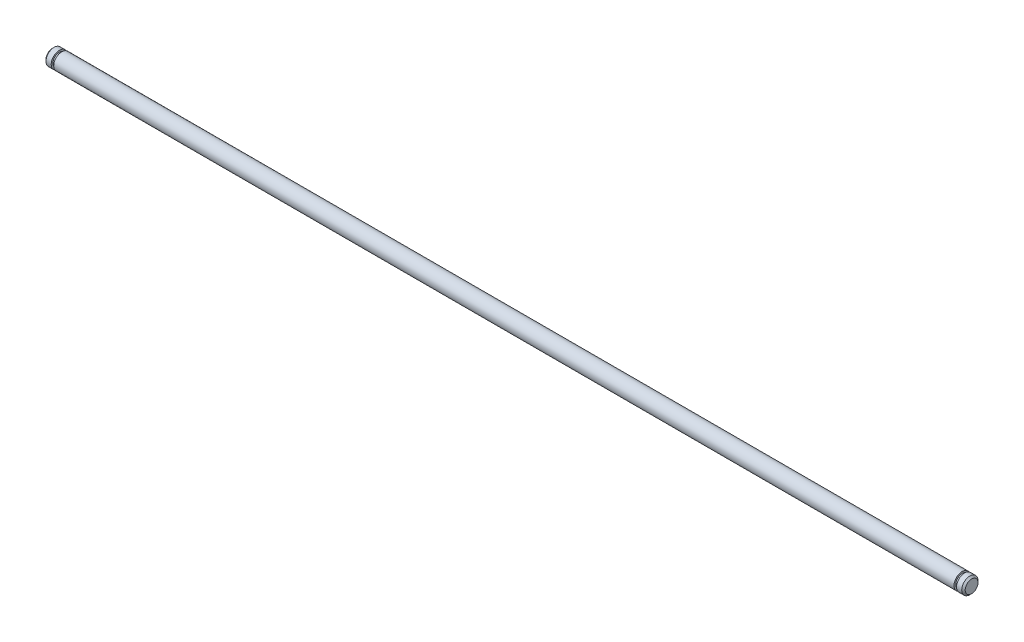
ISO-10303-21;
HEADER;
FILE_DESCRIPTION(('STEP AP214'),'2;1');
FILE_NAME('part.step','',(''),(''),'','','');
FILE_SCHEMA(('AUTOMOTIVE_DESIGN { 1 0 10303 214 1 1 1 1 }'));
ENDSEC;
DATA;
#1=APPLICATION_CONTEXT('core data for automotive mechanical design processes');
#2=APPLICATION_PROTOCOL_DEFINITION('international standard','automotive_design',2000,#1);
#3=PRODUCT_CONTEXT('',#1,'mechanical');
#4=PRODUCT('Part','Part','',(#3));
#5=PRODUCT_RELATED_PRODUCT_CATEGORY('part','',(#4));
#6=PRODUCT_DEFINITION_FORMATION('','',#4);
#7=PRODUCT_DEFINITION_CONTEXT('part definition',#1,'design');
#8=PRODUCT_DEFINITION('design','',#6,#7);
#9=PRODUCT_DEFINITION_SHAPE('','',#8);
#10=(LENGTH_UNIT() NAMED_UNIT(*) SI_UNIT(.MILLI.,.METRE.));
#11=(NAMED_UNIT(*) PLANE_ANGLE_UNIT() SI_UNIT($,.RADIAN.));
#12=(NAMED_UNIT(*) SI_UNIT($,.STERADIAN.) SOLID_ANGLE_UNIT());
#13=UNCERTAINTY_MEASURE_WITH_UNIT(LENGTH_MEASURE(1.E-05),#10,'distance_accuracy_value','');
#14=(GEOMETRIC_REPRESENTATION_CONTEXT(3) GLOBAL_UNCERTAINTY_ASSIGNED_CONTEXT((#13)) GLOBAL_UNIT_ASSIGNED_CONTEXT((#10,
#11,#12)) REPRESENTATION_CONTEXT('',''));
#15=CARTESIAN_POINT('',(0.,0.,0.));
#16=DIRECTION('',(0.,0.,1.));
#17=DIRECTION('',(1.,0.,0.));
#18=AXIS2_PLACEMENT_3D('',#15,#16,#17);
#19=CARTESIAN_POINT('',(-152.7556,0.,0.));
#20=DIRECTION('',(1.,0.,0.));
#21=DIRECTION('',(0.,0.,-1.));
#22=AXIS2_PLACEMENT_3D('',#19,#20,#21);
#23=PLANE('',#22);
#24=CARTESIAN_POINT('',(-152.7556,0.,0.));
#25=DIRECTION('',(1.,0.,0.));
#26=DIRECTION('',(0.,0.,-1.));
#27=AXIS2_PLACEMENT_3D('',#24,#25,#26);
#28=CIRCLE('',#27,1.87324999999994);
#29=CARTESIAN_POINT('',(-152.7556,0.,-1.87324999999994));
#30=VERTEX_POINT('',#29);
#31=EDGE_CURVE('E47',#30,#30,#28,.F.);
#32=ORIENTED_EDGE('',*,*,#31,.T.);
#33=EDGE_LOOP('',(#32));
#34=FACE_BOUND('',#33,.T.);
#35=ADVANCED_FACE('F32',(#34),#23,.F.);
#36=CARTESIAN_POINT('',(116.3066,0.,0.));
#37=DIRECTION('',(-1.,0.,0.));
#38=DIRECTION('',(0.,0.,1.));
#39=AXIS2_PLACEMENT_3D('',#36,#37,#38);
#40=CYLINDRICAL_SURFACE('',#39,2.38125);
#41=CARTESIAN_POINT('',(-152.2476,0.,0.));
#42=DIRECTION('',(1.,0.,0.));
#43=DIRECTION('',(0.,0.,-1.));
#44=AXIS2_PLACEMENT_3D('',#41,#42,#43);
#45=CIRCLE('',#44,2.38125);
#46=CARTESIAN_POINT('',(-152.2476,0.,-2.38125));
#47=VERTEX_POINT('',#46);
#48=EDGE_CURVE('E43',#47,#47,#45,.T.);
#49=ORIENTED_EDGE('',*,*,#48,.T.);
#50=EDGE_LOOP('',(#49));
#51=FACE_BOUND('',#50,.T.);
#52=CARTESIAN_POINT('',(-150.7236,0.,0.));
#53=DIRECTION('',(-1.,0.,0.));
#54=DIRECTION('',(0.,0.,1.));
#55=AXIS2_PLACEMENT_3D('',#52,#53,#54);
#56=CIRCLE('',#55,2.38125);
#57=CARTESIAN_POINT('',(-150.7236,0.,2.38125));
#58=VERTEX_POINT('',#57);
#59=EDGE_CURVE('E52',#58,#58,#56,.T.);
#60=ORIENTED_EDGE('',*,*,#59,.T.);
#61=EDGE_LOOP('',(#60));
#62=FACE_BOUND('',#61,.T.);
#63=ADVANCED_FACE('F93',(#51,#62),#40,.T.);
#64=CARTESIAN_POINT('',(-150.7236,2.38125,0.));
#65=DIRECTION('',(-1.,0.,0.));
#66=DIRECTION('',(0.,0.,1.));
#67=AXIS2_PLACEMENT_3D('',#64,#65,#66);
#68=PLANE('',#67);
#69=ORIENTED_EDGE('',*,*,#59,.F.);
#70=EDGE_LOOP('',(#69));
#71=FACE_BOUND('',#70,.T.);
#72=CARTESIAN_POINT('',(-150.7236,0.,0.));
#73=DIRECTION('',(-1.,0.,0.));
#74=DIRECTION('',(0.,0.,1.));
#75=AXIS2_PLACEMENT_3D('',#72,#73,#74);
#76=CIRCLE('',#75,1.86689999999992);
#77=CARTESIAN_POINT('',(-150.7236,0.,1.86689999999992));
#78=VERTEX_POINT('',#77);
#79=EDGE_CURVE('E55',#78,#78,#76,.T.);
#80=ORIENTED_EDGE('',*,*,#79,.T.);
#81=EDGE_LOOP('',(#80));
#82=FACE_BOUND('',#81,.T.);
#83=ADVANCED_FACE('F99',(#71,#82),#68,.F.);
#84=CARTESIAN_POINT('',(116.3066,0.,0.));
#85=DIRECTION('',(-1.,0.,0.));
#86=DIRECTION('',(0.,0.,1.));
#87=AXIS2_PLACEMENT_3D('',#84,#85,#86);
#88=CYLINDRICAL_SURFACE('',#87,1.86689999999994);
#89=ORIENTED_EDGE('',*,*,#79,.F.);
#90=EDGE_LOOP('',(#89));
#91=FACE_BOUND('',#90,.T.);
#92=CARTESIAN_POINT('',(-149.987,0.,0.));
#93=DIRECTION('',(-1.,0.,0.));
#94=DIRECTION('',(0.,0.,1.));
#95=AXIS2_PLACEMENT_3D('',#92,#93,#94);
#96=CIRCLE('',#95,1.86689999999997);
#97=CARTESIAN_POINT('',(-149.987,0.,1.86689999999997));
#98=VERTEX_POINT('',#97);
#99=EDGE_CURVE('E58',#98,#98,#96,.T.);
#100=ORIENTED_EDGE('',*,*,#99,.T.);
#101=EDGE_LOOP('',(#100));
#102=FACE_BOUND('',#101,.T.);
#103=ADVANCED_FACE('F117',(#91,#102),#88,.T.);
#104=CARTESIAN_POINT('',(-149.987,2.38124999999995,0.));
#105=DIRECTION('',(1.,0.,0.));
#106=DIRECTION('',(0.,0.,-1.));
#107=AXIS2_PLACEMENT_3D('',#104,#105,#106);
#108=PLANE('',#107);
#109=ORIENTED_EDGE('',*,*,#99,.F.);
#110=EDGE_LOOP('',(#109));
#111=FACE_BOUND('',#110,.T.);
#112=CARTESIAN_POINT('',(-149.987,0.,0.));
#113=DIRECTION('',(-1.,0.,0.));
#114=DIRECTION('',(0.,0.,1.));
#115=AXIS2_PLACEMENT_3D('',#112,#113,#114);
#116=CIRCLE('',#115,2.38124999999995);
#117=CARTESIAN_POINT('',(-149.987,0.,2.38124999999995));
#118=VERTEX_POINT('',#117);
#119=EDGE_CURVE('E61',#118,#118,#116,.T.);
#120=ORIENTED_EDGE('',*,*,#119,.T.);
#121=EDGE_LOOP('',(#120));
#122=FACE_BOUND('',#121,.T.);
#123=ADVANCED_FACE('F122',(#111,#122),#108,.F.);
#124=CARTESIAN_POINT('',(116.3066,0.,0.));
#125=DIRECTION('',(-1.,0.,0.));
#126=DIRECTION('',(0.,0.,1.));
#127=AXIS2_PLACEMENT_3D('',#124,#125,#126);
#128=CYLINDRICAL_SURFACE('',#127,2.38124999999998);
#129=ORIENTED_EDGE('',*,*,#119,.F.);
#130=EDGE_LOOP('',(#129));
#131=FACE_BOUND('',#130,.T.);
#132=CARTESIAN_POINT('',(113.538,0.,0.));
#133=DIRECTION('',(-1.,0.,0.));
#134=DIRECTION('',(0.,0.,1.));
#135=AXIS2_PLACEMENT_3D('',#132,#133,#134);
#136=CIRCLE('',#135,2.38125);
#137=CARTESIAN_POINT('',(113.538,0.,2.38125));
#138=VERTEX_POINT('',#137);
#139=EDGE_CURVE('E64',#138,#138,#136,.T.);
#140=ORIENTED_EDGE('',*,*,#139,.T.);
#141=EDGE_LOOP('',(#140));
#142=FACE_BOUND('',#141,.T.);
#143=ADVANCED_FACE('F128',(#131,#142),#128,.T.);
#144=CARTESIAN_POINT('',(113.538,2.38125,0.));
#145=DIRECTION('',(-1.,0.,0.));
#146=DIRECTION('',(0.,0.,1.));
#147=AXIS2_PLACEMENT_3D('',#144,#145,#146);
#148=PLANE('',#147);
#149=ORIENTED_EDGE('',*,*,#139,.F.);
#150=EDGE_LOOP('',(#149));
#151=FACE_BOUND('',#150,.T.);
#152=CARTESIAN_POINT('',(113.538,0.,0.));
#153=DIRECTION('',(-1.,0.,0.));
#154=DIRECTION('',(0.,0.,1.));
#155=AXIS2_PLACEMENT_3D('',#152,#153,#154);
#156=CIRCLE('',#155,1.86690000000008);
#157=CARTESIAN_POINT('',(113.538,0.,1.86690000000008));
#158=VERTEX_POINT('',#157);
#159=EDGE_CURVE('E67',#158,#158,#156,.T.);
#160=ORIENTED_EDGE('',*,*,#159,.T.);
#161=EDGE_LOOP('',(#160));
#162=FACE_BOUND('',#161,.T.);
#163=ADVANCED_FACE('F134',(#151,#162),#148,.F.);
#164=CARTESIAN_POINT('',(116.3066,0.,0.));
#165=DIRECTION('',(-1.,0.,0.));
#166=DIRECTION('',(0.,0.,1.));
#167=AXIS2_PLACEMENT_3D('',#164,#165,#166);
#168=CYLINDRICAL_SURFACE('',#167,1.86690000000008);
#169=ORIENTED_EDGE('',*,*,#159,.F.);
#170=EDGE_LOOP('',(#169));
#171=FACE_BOUND('',#170,.T.);
#172=CARTESIAN_POINT('',(114.2746,0.,0.));
#173=DIRECTION('',(-1.,0.,0.));
#174=DIRECTION('',(0.,0.,1.));
#175=AXIS2_PLACEMENT_3D('',#172,#173,#174);
#176=CIRCLE('',#175,1.86690000000008);
#177=CARTESIAN_POINT('',(114.2746,0.,1.86690000000008));
#178=VERTEX_POINT('',#177);
#179=EDGE_CURVE('E70',#178,#178,#176,.T.);
#180=ORIENTED_EDGE('',*,*,#179,.T.);
#181=EDGE_LOOP('',(#180));
#182=FACE_BOUND('',#181,.T.);
#183=ADVANCED_FACE('F89',(#171,#182),#168,.T.);
#184=CARTESIAN_POINT('',(114.2746,2.38125,0.));
#185=DIRECTION('',(1.,0.,0.));
#186=DIRECTION('',(0.,0.,-1.));
#187=AXIS2_PLACEMENT_3D('',#184,#185,#186);
#188=PLANE('',#187);
#189=ORIENTED_EDGE('',*,*,#179,.F.);
#190=EDGE_LOOP('',(#189));
#191=FACE_BOUND('',#190,.T.);
#192=CARTESIAN_POINT('',(114.2746,0.,0.));
#193=DIRECTION('',(-1.,0.,0.));
#194=DIRECTION('',(0.,0.,1.));
#195=AXIS2_PLACEMENT_3D('',#192,#193,#194);
#196=CIRCLE('',#195,2.38125);
#197=CARTESIAN_POINT('',(114.2746,0.,2.38125));
#198=VERTEX_POINT('',#197);
#199=EDGE_CURVE('E73',#198,#198,#196,.T.);
#200=ORIENTED_EDGE('',*,*,#199,.T.);
#201=EDGE_LOOP('',(#200));
#202=FACE_BOUND('',#201,.T.);
#203=ADVANCED_FACE('F77',(#191,#202),#188,.F.);
#204=CARTESIAN_POINT('',(116.3066,0.,0.));
#205=DIRECTION('',(-1.,0.,0.));
#206=DIRECTION('',(0.,0.,1.));
#207=AXIS2_PLACEMENT_3D('',#204,#205,#206);
#208=CYLINDRICAL_SURFACE('',#207,2.38125);
#209=CARTESIAN_POINT('',(115.7986,0.,0.));
#210=DIRECTION('',(-1.,0.,0.));
#211=DIRECTION('',(0.,0.,1.));
#212=AXIS2_PLACEMENT_3D('',#209,#210,#211);
#213=CIRCLE('',#212,2.38125);
#214=CARTESIAN_POINT('',(115.7986,0.,2.38125));
#215=VERTEX_POINT('',#214);
#216=EDGE_CURVE('E39',#215,#215,#213,.T.);
#217=ORIENTED_EDGE('',*,*,#216,.T.);
#218=EDGE_LOOP('',(#217));
#219=FACE_BOUND('',#218,.T.);
#220=ORIENTED_EDGE('',*,*,#199,.F.);
#221=EDGE_LOOP('',(#220));
#222=FACE_BOUND('',#221,.T.);
#223=ADVANCED_FACE('F79',(#219,#222),#208,.T.);
#224=CARTESIAN_POINT('',(116.3066,0.,0.));
#225=DIRECTION('',(-1.,0.,0.));
#226=DIRECTION('',(0.,0.,1.));
#227=AXIS2_PLACEMENT_3D('',#224,#225,#226);
#228=PLANE('',#227);
#229=CARTESIAN_POINT('',(116.3066,0.,0.));
#230=DIRECTION('',(-1.,0.,0.));
#231=DIRECTION('',(0.,0.,1.));
#232=AXIS2_PLACEMENT_3D('',#229,#230,#231);
#233=CIRCLE('',#232,1.87324999999994);
#234=CARTESIAN_POINT('',(116.3066,0.,1.87324999999994));
#235=VERTEX_POINT('',#234);
#236=EDGE_CURVE('E10',#235,#235,#233,.F.);
#237=ORIENTED_EDGE('',*,*,#236,.T.);
#238=EDGE_LOOP('',(#237));
#239=FACE_BOUND('',#238,.T.);
#240=ADVANCED_FACE('F81',(#239),#228,.F.);
#241=CARTESIAN_POINT('',(-152.7556,0.,0.));
#242=DIRECTION('',(1.,0.,0.));
#243=DIRECTION('',(0.,0.,-1.));
#244=AXIS2_PLACEMENT_3D('',#241,#242,#243);
#245=CONICAL_SURFACE('',#244,1.87324999999997,0.785398163397474);
#246=ORIENTED_EDGE('',*,*,#48,.F.);
#247=EDGE_LOOP('',(#246));
#248=FACE_BOUND('',#247,.T.);
#249=ORIENTED_EDGE('',*,*,#31,.F.);
#250=EDGE_LOOP('',(#249));
#251=FACE_BOUND('',#250,.T.);
#252=ADVANCED_FACE('F87',(#248,#251),#245,.T.);
#253=CARTESIAN_POINT('',(115.7986,0.,0.));
#254=DIRECTION('',(-1.,0.,0.));
#255=DIRECTION('',(0.,0.,1.));
#256=AXIS2_PLACEMENT_3D('',#253,#254,#255);
#257=CONICAL_SURFACE('',#256,2.38125,0.785398163397447);
#258=ORIENTED_EDGE('',*,*,#236,.F.);
#259=EDGE_LOOP('',(#258));
#260=FACE_BOUND('',#259,.T.);
#261=ORIENTED_EDGE('',*,*,#216,.F.);
#262=EDGE_LOOP('',(#261));
#263=FACE_BOUND('',#262,.T.);
#264=ADVANCED_FACE('F34',(#260,#263),#257,.T.);
#265=CLOSED_SHELL('',(#35,#63,#83,#103,#123,#143,#163,#183,#203,#223,#240,#252,#264));
#266=MANIFOLD_SOLID_BREP('B2',#265);
#267=ADVANCED_BREP_SHAPE_REPRESENTATION('',(#18,#266),#14);
#268=SHAPE_DEFINITION_REPRESENTATION(#9,#267);
ENDSEC;
END-ISO-10303-21;
